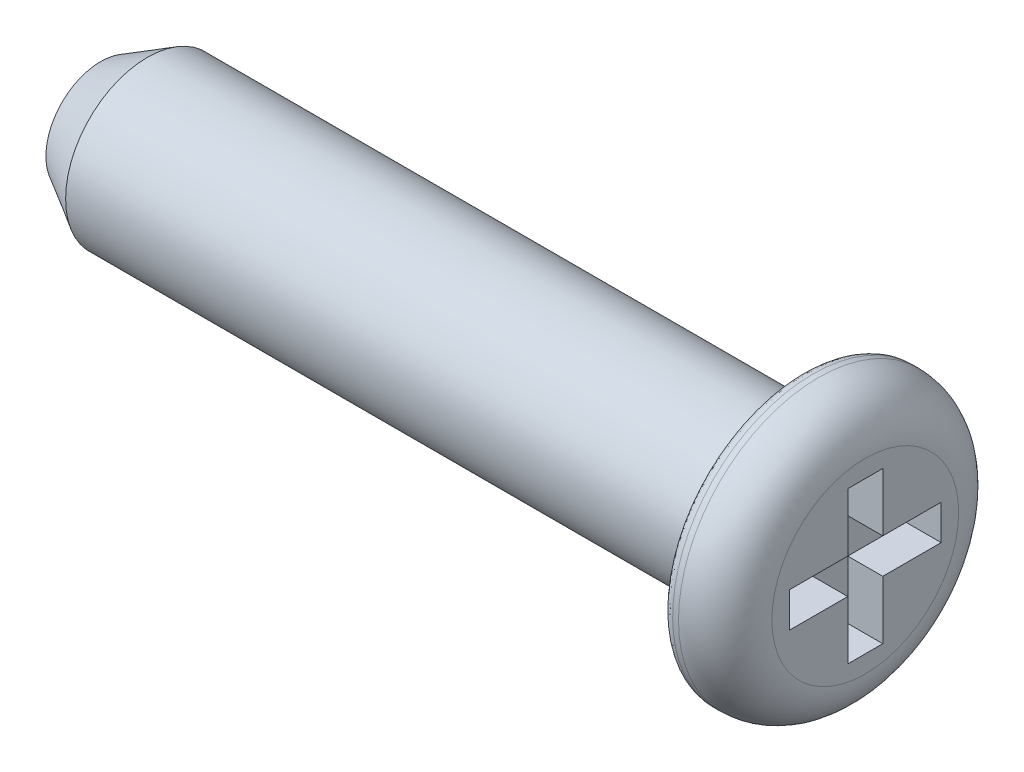
ISO-10303-21;
HEADER;
FILE_DESCRIPTION(('STEP AP214'),'2;1');
FILE_NAME('part.step','',(''),(''),'','','');
FILE_SCHEMA(('AUTOMOTIVE_DESIGN { 1 0 10303 214 1 1 1 1 }'));
ENDSEC;
DATA;
#1=APPLICATION_CONTEXT('core data for automotive mechanical design processes');
#2=APPLICATION_PROTOCOL_DEFINITION('international standard','automotive_design',2000,#1);
#3=PRODUCT_CONTEXT('',#1,'mechanical');
#4=PRODUCT('Part','Part','',(#3));
#5=PRODUCT_RELATED_PRODUCT_CATEGORY('part','',(#4));
#6=PRODUCT_DEFINITION_FORMATION('','',#4);
#7=PRODUCT_DEFINITION_CONTEXT('part definition',#1,'design');
#8=PRODUCT_DEFINITION('design','',#6,#7);
#9=PRODUCT_DEFINITION_SHAPE('','',#8);
#10=(LENGTH_UNIT() NAMED_UNIT(*) SI_UNIT(.MILLI.,.METRE.));
#11=(NAMED_UNIT(*) PLANE_ANGLE_UNIT() SI_UNIT($,.RADIAN.));
#12=(NAMED_UNIT(*) SI_UNIT($,.STERADIAN.) SOLID_ANGLE_UNIT());
#13=UNCERTAINTY_MEASURE_WITH_UNIT(LENGTH_MEASURE(1.E-05),#10,'distance_accuracy_value','');
#14=(GEOMETRIC_REPRESENTATION_CONTEXT(3) GLOBAL_UNCERTAINTY_ASSIGNED_CONTEXT((#13)) GLOBAL_UNIT_ASSIGNED_CONTEXT((#10,
#11,#12)) REPRESENTATION_CONTEXT('',''));
#15=CARTESIAN_POINT('',(0.,0.,0.));
#16=DIRECTION('',(0.,0.,1.));
#17=DIRECTION('',(1.,0.,0.));
#18=AXIS2_PLACEMENT_3D('',#15,#16,#17);
#19=CARTESIAN_POINT('',(6.75,29.024,-5.524));
#20=DIRECTION('',(1.,0.,0.));
#21=DIRECTION('',(0.,0.,-1.));
#22=AXIS2_PLACEMENT_3D('',#19,#20,#21);
#23=PLANE('',#22);
#24=DIRECTION('',(0.,-1.,0.));
#25=VECTOR('',#24,1.);
#26=CARTESIAN_POINT('',(6.75,29.7,-5.55));
#27=LINE('',#26,#25);
#28=CARTESIAN_POINT('',(6.75,29.85,-5.55));
#29=VERTEX_POINT('',#28);
#30=CARTESIAN_POINT('',(6.75,29.55,-5.55));
#31=VERTEX_POINT('',#30);
#32=EDGE_CURVE('E177',#29,#31,#27,.T.);
#33=ORIENTED_EDGE('',*,*,#32,.T.);
#34=DIRECTION('',(0.,0.,-1.));
#35=VECTOR('',#34,1.);
#36=CARTESIAN_POINT('',(6.75,29.55,-5.8));
#37=LINE('',#36,#35);
#38=CARTESIAN_POINT('',(6.75,29.55,-6.05));
#39=VERTEX_POINT('',#38);
#40=EDGE_CURVE('E370',#31,#39,#37,.T.);
#41=ORIENTED_EDGE('',*,*,#40,.T.);
#42=DIRECTION('',(0.,-1.,0.));
#43=VECTOR('',#42,1.);
#44=CARTESIAN_POINT('',(6.75,29.3,-6.05));
#45=LINE('',#44,#43);
#46=CARTESIAN_POINT('',(6.75,29.05,-6.05));
#47=VERTEX_POINT('',#46);
#48=EDGE_CURVE('E363',#39,#47,#45,.T.);
#49=ORIENTED_EDGE('',*,*,#48,.T.);
#50=DIRECTION('',(0.,0.,-1.));
#51=VECTOR('',#50,1.);
#52=CARTESIAN_POINT('',(6.75,29.05,-6.2));
#53=LINE('',#52,#51);
#54=CARTESIAN_POINT('',(6.75,29.05,-6.35));
#55=VERTEX_POINT('',#54);
#56=EDGE_CURVE('E356',#47,#55,#53,.T.);
#57=ORIENTED_EDGE('',*,*,#56,.T.);
#58=DIRECTION('',(0.,1.,0.));
#59=VECTOR('',#58,1.);
#60=CARTESIAN_POINT('',(6.75,29.3,-6.35));
#61=LINE('',#60,#59);
#62=CARTESIAN_POINT('',(6.75,29.55,-6.35));
#63=VERTEX_POINT('',#62);
#64=EDGE_CURVE('E349',#55,#63,#61,.T.);
#65=ORIENTED_EDGE('',*,*,#64,.T.);
#66=DIRECTION('',(0.,0.,-1.));
#67=VECTOR('',#66,1.);
#68=CARTESIAN_POINT('',(6.75,29.55,-6.6));
#69=LINE('',#68,#67);
#70=CARTESIAN_POINT('',(6.75,29.55,-6.85));
#71=VERTEX_POINT('',#70);
#72=EDGE_CURVE('E342',#63,#71,#69,.T.);
#73=ORIENTED_EDGE('',*,*,#72,.T.);
#74=DIRECTION('',(0.,1.,0.));
#75=VECTOR('',#74,1.);
#76=CARTESIAN_POINT('',(6.75,29.7,-6.85));
#77=LINE('',#76,#75);
#78=CARTESIAN_POINT('',(6.75,29.85,-6.85));
#79=VERTEX_POINT('',#78);
#80=EDGE_CURVE('E335',#71,#79,#77,.T.);
#81=ORIENTED_EDGE('',*,*,#80,.T.);
#82=DIRECTION('',(0.,0.,1.));
#83=VECTOR('',#82,1.);
#84=CARTESIAN_POINT('',(6.75,29.85,-6.6));
#85=LINE('',#84,#83);
#86=CARTESIAN_POINT('',(6.75,29.85,-6.35));
#87=VERTEX_POINT('',#86);
#88=EDGE_CURVE('E328',#79,#87,#85,.T.);
#89=ORIENTED_EDGE('',*,*,#88,.T.);
#90=DIRECTION('',(0.,1.,0.));
#91=VECTOR('',#90,1.);
#92=CARTESIAN_POINT('',(6.75,30.1,-6.35));
#93=LINE('',#92,#91);
#94=CARTESIAN_POINT('',(6.75,30.35,-6.35));
#95=VERTEX_POINT('',#94);
#96=EDGE_CURVE('E321',#87,#95,#93,.T.);
#97=ORIENTED_EDGE('',*,*,#96,.T.);
#98=DIRECTION('',(0.,0.,1.));
#99=VECTOR('',#98,1.);
#100=CARTESIAN_POINT('',(6.75,30.35,-6.2));
#101=LINE('',#100,#99);
#102=CARTESIAN_POINT('',(6.75,30.35,-6.05));
#103=VERTEX_POINT('',#102);
#104=EDGE_CURVE('E153',#95,#103,#101,.T.);
#105=ORIENTED_EDGE('',*,*,#104,.T.);
#106=DIRECTION('',(0.,-1.,0.));
#107=VECTOR('',#106,1.);
#108=CARTESIAN_POINT('',(6.75,30.1,-6.05));
#109=LINE('',#108,#107);
#110=CARTESIAN_POINT('',(6.75,29.85,-6.05));
#111=VERTEX_POINT('',#110);
#112=EDGE_CURVE('E150',#103,#111,#109,.T.);
#113=ORIENTED_EDGE('',*,*,#112,.T.);
#114=DIRECTION('',(0.,0.,1.));
#115=VECTOR('',#114,1.);
#116=CARTESIAN_POINT('',(6.75,29.85,-5.8));
#117=LINE('',#116,#115);
#118=EDGE_CURVE('E146',#111,#29,#117,.T.);
#119=ORIENTED_EDGE('',*,*,#118,.T.);
#120=EDGE_LOOP('',(#33,#41,#49,#57,#65,#73,#81,#89,#97,#105,#113,#119));
#121=FACE_BOUND('',#120,.T.);
#122=ADVANCED_FACE('F16',(#121),#23,.T.);
#123=CARTESIAN_POINT('',(6.741146467985,30.36,-6.05));
#124=DIRECTION('',(0.,0.,1.));
#125=DIRECTION('',(0.,-1.,0.));
#126=AXIS2_PLACEMENT_3D('',#123,#124,#125);
#127=PLANE('',#126);
#128=ORIENTED_EDGE('',*,*,#112,.F.);
#129=DIRECTION('',(1.,0.,0.));
#130=VECTOR('',#129,1.);
#131=CARTESIAN_POINT('',(6.9,30.35,-6.05));
#132=LINE('',#131,#130);
#133=CARTESIAN_POINT('',(7.05,30.35,-6.05));
#134=VERTEX_POINT('',#133);
#135=EDGE_CURVE('E307',#103,#134,#132,.T.);
#136=ORIENTED_EDGE('',*,*,#135,.T.);
#137=DIRECTION('',(0.,1.,0.));
#138=VECTOR('',#137,1.);
#139=CARTESIAN_POINT('',(7.05,29.7,-6.05));
#140=LINE('',#139,#138);
#141=CARTESIAN_POINT('',(7.05,29.85,-6.05));
#142=VERTEX_POINT('',#141);
#143=EDGE_CURVE('E162',#134,#142,#140,.F.);
#144=ORIENTED_EDGE('',*,*,#143,.T.);
#145=DIRECTION('',(-1.,0.,0.));
#146=VECTOR('',#145,1.);
#147=CARTESIAN_POINT('',(6.9,29.85,-6.05));
#148=LINE('',#147,#146);
#149=EDGE_CURVE('E157',#142,#111,#148,.T.);
#150=ORIENTED_EDGE('',*,*,#149,.T.);
#151=EDGE_LOOP('',(#128,#136,#144,#150));
#152=FACE_BOUND('',#151,.T.);
#153=ADVANCED_FACE('F160',(#152),#127,.F.);
#154=CARTESIAN_POINT('',(6.741146467985,29.85,-6.06));
#155=DIRECTION('',(0.,1.,0.));
#156=DIRECTION('',(0.,0.,1.));
#157=AXIS2_PLACEMENT_3D('',#154,#155,#156);
#158=PLANE('',#157);
#159=ORIENTED_EDGE('',*,*,#118,.F.);
#160=ORIENTED_EDGE('',*,*,#149,.F.);
#161=DIRECTION('',(0.,0.,-1.));
#162=VECTOR('',#161,1.);
#163=CARTESIAN_POINT('',(7.05,29.85,-6.2));
#164=LINE('',#163,#162);
#165=CARTESIAN_POINT('',(7.05,29.85,-5.55));
#166=VERTEX_POINT('',#165);
#167=EDGE_CURVE('E430',#142,#166,#164,.F.);
#168=ORIENTED_EDGE('',*,*,#167,.T.);
#169=DIRECTION('',(-1.,0.,0.));
#170=VECTOR('',#169,1.);
#171=CARTESIAN_POINT('',(6.9,29.85,-5.55));
#172=LINE('',#171,#170);
#173=EDGE_CURVE('E169',#166,#29,#172,.T.);
#174=ORIENTED_EDGE('',*,*,#173,.T.);
#175=EDGE_LOOP('',(#159,#160,#168,#174));
#176=FACE_BOUND('',#175,.T.);
#177=ADVANCED_FACE('F167',(#176),#158,.F.);
#178=CARTESIAN_POINT('',(6.741146467985,29.85885353202,-5.55));
#179=DIRECTION('',(0.,0.,1.));
#180=DIRECTION('',(0.,-1.,0.));
#181=AXIS2_PLACEMENT_3D('',#178,#179,#180);
#182=PLANE('',#181);
#183=ORIENTED_EDGE('',*,*,#32,.F.);
#184=ORIENTED_EDGE('',*,*,#173,.F.);
#185=DIRECTION('',(0.,1.,0.));
#186=VECTOR('',#185,1.);
#187=CARTESIAN_POINT('',(7.05,29.7,-5.55));
#188=LINE('',#187,#186);
#189=CARTESIAN_POINT('',(7.05,29.55,-5.55));
#190=VERTEX_POINT('',#189);
#191=EDGE_CURVE('E380',#166,#190,#188,.F.);
#192=ORIENTED_EDGE('',*,*,#191,.T.);
#193=DIRECTION('',(-1.,0.,0.));
#194=VECTOR('',#193,1.);
#195=CARTESIAN_POINT('',(6.9,29.55,-5.55));
#196=LINE('',#195,#194);
#197=EDGE_CURVE('E372',#190,#31,#196,.T.);
#198=ORIENTED_EDGE('',*,*,#197,.T.);
#199=EDGE_LOOP('',(#183,#184,#192,#198));
#200=FACE_BOUND('',#199,.T.);
#201=ADVANCED_FACE('F378',(#200),#182,.F.);
#202=CARTESIAN_POINT('',(6.741146467985,29.55,-5.54));
#203=DIRECTION('',(0.,-1.,0.));
#204=DIRECTION('',(0.,0.,-1.));
#205=AXIS2_PLACEMENT_3D('',#202,#203,#204);
#206=PLANE('',#205);
#207=ORIENTED_EDGE('',*,*,#40,.F.);
#208=ORIENTED_EDGE('',*,*,#197,.F.);
#209=DIRECTION('',(0.,0.,1.));
#210=VECTOR('',#209,1.);
#211=CARTESIAN_POINT('',(7.05,29.55,-6.2));
#212=LINE('',#211,#210);
#213=CARTESIAN_POINT('',(7.05,29.55,-6.05));
#214=VERTEX_POINT('',#213);
#215=EDGE_CURVE('E386',#190,#214,#212,.F.);
#216=ORIENTED_EDGE('',*,*,#215,.T.);
#217=DIRECTION('',(-1.,0.,0.));
#218=VECTOR('',#217,1.);
#219=CARTESIAN_POINT('',(6.9,29.55,-6.05));
#220=LINE('',#219,#218);
#221=EDGE_CURVE('E366',#214,#39,#220,.T.);
#222=ORIENTED_EDGE('',*,*,#221,.T.);
#223=EDGE_LOOP('',(#207,#208,#216,#222));
#224=FACE_BOUND('',#223,.T.);
#225=ADVANCED_FACE('F383',(#224),#206,.F.);
#226=CARTESIAN_POINT('',(6.741146467985,29.56,-6.05));
#227=DIRECTION('',(0.,0.,1.));
#228=DIRECTION('',(0.,-1.,0.));
#229=AXIS2_PLACEMENT_3D('',#226,#227,#228);
#230=PLANE('',#229);
#231=ORIENTED_EDGE('',*,*,#48,.F.);
#232=ORIENTED_EDGE('',*,*,#221,.F.);
#233=DIRECTION('',(0.,1.,0.));
#234=VECTOR('',#233,1.);
#235=CARTESIAN_POINT('',(7.05,29.7,-6.05));
#236=LINE('',#235,#234);
#237=CARTESIAN_POINT('',(7.05,29.05,-6.05));
#238=VERTEX_POINT('',#237);
#239=EDGE_CURVE('E439',#214,#238,#236,.F.);
#240=ORIENTED_EDGE('',*,*,#239,.T.);
#241=DIRECTION('',(-1.,0.,0.));
#242=VECTOR('',#241,1.);
#243=CARTESIAN_POINT('',(6.9,29.05,-6.05));
#244=LINE('',#243,#242);
#245=EDGE_CURVE('E359',#238,#47,#244,.T.);
#246=ORIENTED_EDGE('',*,*,#245,.T.);
#247=EDGE_LOOP('',(#231,#232,#240,#246));
#248=FACE_BOUND('',#247,.T.);
#249=ADVANCED_FACE('F389',(#248),#230,.F.);
#250=CARTESIAN_POINT('',(6.741146467985,29.05,-6.041146467985));
#251=DIRECTION('',(0.,-1.,0.));
#252=DIRECTION('',(0.,0.,-1.));
#253=AXIS2_PLACEMENT_3D('',#250,#251,#252);
#254=PLANE('',#253);
#255=ORIENTED_EDGE('',*,*,#56,.F.);
#256=ORIENTED_EDGE('',*,*,#245,.F.);
#257=DIRECTION('',(0.,0.,1.));
#258=VECTOR('',#257,1.);
#259=CARTESIAN_POINT('',(7.05,29.05,-6.2));
#260=LINE('',#259,#258);
#261=CARTESIAN_POINT('',(7.05,29.05,-6.35));
#262=VERTEX_POINT('',#261);
#263=EDGE_CURVE('E397',#238,#262,#260,.F.);
#264=ORIENTED_EDGE('',*,*,#263,.T.);
#265=DIRECTION('',(-1.,0.,0.));
#266=VECTOR('',#265,1.);
#267=CARTESIAN_POINT('',(6.9,29.05,-6.35));
#268=LINE('',#267,#266);
#269=EDGE_CURVE('E352',#262,#55,#268,.T.);
#270=ORIENTED_EDGE('',*,*,#269,.T.);
#271=EDGE_LOOP('',(#255,#256,#264,#270));
#272=FACE_BOUND('',#271,.T.);
#273=ADVANCED_FACE('F395',(#272),#254,.F.);
#274=CARTESIAN_POINT('',(6.741146467985,29.04,-6.35));
#275=DIRECTION('',(0.,0.,-1.));
#276=DIRECTION('',(0.,1.,0.));
#277=AXIS2_PLACEMENT_3D('',#274,#275,#276);
#278=PLANE('',#277);
#279=ORIENTED_EDGE('',*,*,#64,.F.);
#280=ORIENTED_EDGE('',*,*,#269,.F.);
#281=DIRECTION('',(0.,-1.,0.));
#282=VECTOR('',#281,1.);
#283=CARTESIAN_POINT('',(7.05,29.7,-6.35));
#284=LINE('',#283,#282);
#285=CARTESIAN_POINT('',(7.05,29.55,-6.35));
#286=VERTEX_POINT('',#285);
#287=EDGE_CURVE('E403',#262,#286,#284,.F.);
#288=ORIENTED_EDGE('',*,*,#287,.T.);
#289=DIRECTION('',(-1.,0.,0.));
#290=VECTOR('',#289,1.);
#291=CARTESIAN_POINT('',(6.9,29.55,-6.35));
#292=LINE('',#291,#290);
#293=EDGE_CURVE('E345',#286,#63,#292,.T.);
#294=ORIENTED_EDGE('',*,*,#293,.T.);
#295=EDGE_LOOP('',(#279,#280,#288,#294));
#296=FACE_BOUND('',#295,.T.);
#297=ADVANCED_FACE('F400',(#296),#278,.F.);
#298=CARTESIAN_POINT('',(6.741146467985,29.55,-6.34));
#299=DIRECTION('',(0.,-1.,0.));
#300=DIRECTION('',(0.,0.,-1.));
#301=AXIS2_PLACEMENT_3D('',#298,#299,#300);
#302=PLANE('',#301);
#303=ORIENTED_EDGE('',*,*,#72,.F.);
#304=ORIENTED_EDGE('',*,*,#293,.F.);
#305=DIRECTION('',(0.,0.,1.));
#306=VECTOR('',#305,1.);
#307=CARTESIAN_POINT('',(7.05,29.55,-6.2));
#308=LINE('',#307,#306);
#309=CARTESIAN_POINT('',(7.05,29.55,-6.85));
#310=VERTEX_POINT('',#309);
#311=EDGE_CURVE('E446',#286,#310,#308,.F.);
#312=ORIENTED_EDGE('',*,*,#311,.T.);
#313=DIRECTION('',(-1.,0.,0.));
#314=VECTOR('',#313,1.);
#315=CARTESIAN_POINT('',(6.9,29.55,-6.85));
#316=LINE('',#315,#314);
#317=EDGE_CURVE('E338',#310,#71,#316,.T.);
#318=ORIENTED_EDGE('',*,*,#317,.T.);
#319=EDGE_LOOP('',(#303,#304,#312,#318));
#320=FACE_BOUND('',#319,.T.);
#321=ADVANCED_FACE('F406',(#320),#302,.F.);
#322=CARTESIAN_POINT('',(6.741146467985,29.54114646798,-6.85));
#323=DIRECTION('',(0.,0.,-1.));
#324=DIRECTION('',(0.,1.,0.));
#325=AXIS2_PLACEMENT_3D('',#322,#323,#324);
#326=PLANE('',#325);
#327=ORIENTED_EDGE('',*,*,#80,.F.);
#328=ORIENTED_EDGE('',*,*,#317,.F.);
#329=DIRECTION('',(0.,-1.,0.));
#330=VECTOR('',#329,1.);
#331=CARTESIAN_POINT('',(7.05,29.7,-6.85));
#332=LINE('',#331,#330);
#333=CARTESIAN_POINT('',(7.05,29.85,-6.85));
#334=VERTEX_POINT('',#333);
#335=EDGE_CURVE('E414',#310,#334,#332,.F.);
#336=ORIENTED_EDGE('',*,*,#335,.T.);
#337=DIRECTION('',(-1.,0.,0.));
#338=VECTOR('',#337,1.);
#339=CARTESIAN_POINT('',(6.9,29.85,-6.85));
#340=LINE('',#339,#338);
#341=EDGE_CURVE('E331',#334,#79,#340,.T.);
#342=ORIENTED_EDGE('',*,*,#341,.T.);
#343=EDGE_LOOP('',(#327,#328,#336,#342));
#344=FACE_BOUND('',#343,.T.);
#345=ADVANCED_FACE('F412',(#344),#326,.F.);
#346=CARTESIAN_POINT('',(6.741146467985,29.85,-6.86));
#347=DIRECTION('',(0.,1.,0.));
#348=DIRECTION('',(0.,0.,1.));
#349=AXIS2_PLACEMENT_3D('',#346,#347,#348);
#350=PLANE('',#349);
#351=ORIENTED_EDGE('',*,*,#88,.F.);
#352=ORIENTED_EDGE('',*,*,#341,.F.);
#353=DIRECTION('',(0.,0.,-1.));
#354=VECTOR('',#353,1.);
#355=CARTESIAN_POINT('',(7.05,29.85,-6.2));
#356=LINE('',#355,#354);
#357=CARTESIAN_POINT('',(7.05,29.85,-6.35));
#358=VERTEX_POINT('',#357);
#359=EDGE_CURVE('E420',#334,#358,#356,.F.);
#360=ORIENTED_EDGE('',*,*,#359,.T.);
#361=DIRECTION('',(-1.,0.,0.));
#362=VECTOR('',#361,1.);
#363=CARTESIAN_POINT('',(6.9,29.85,-6.35));
#364=LINE('',#363,#362);
#365=EDGE_CURVE('E324',#358,#87,#364,.T.);
#366=ORIENTED_EDGE('',*,*,#365,.T.);
#367=EDGE_LOOP('',(#351,#352,#360,#366));
#368=FACE_BOUND('',#367,.T.);
#369=ADVANCED_FACE('F417',(#368),#350,.F.);
#370=CARTESIAN_POINT('',(6.741146467985,29.84,-6.35));
#371=DIRECTION('',(0.,0.,-1.));
#372=DIRECTION('',(0.,1.,0.));
#373=AXIS2_PLACEMENT_3D('',#370,#371,#372);
#374=PLANE('',#373);
#375=ORIENTED_EDGE('',*,*,#96,.F.);
#376=ORIENTED_EDGE('',*,*,#365,.F.);
#377=DIRECTION('',(0.,-1.,0.));
#378=VECTOR('',#377,1.);
#379=CARTESIAN_POINT('',(7.05,29.7,-6.35));
#380=LINE('',#379,#378);
#381=CARTESIAN_POINT('',(7.05,30.35,-6.35));
#382=VERTEX_POINT('',#381);
#383=EDGE_CURVE('E425',#358,#382,#380,.F.);
#384=ORIENTED_EDGE('',*,*,#383,.T.);
#385=DIRECTION('',(-1.,0.,0.));
#386=VECTOR('',#385,1.);
#387=CARTESIAN_POINT('',(6.9,30.35,-6.35));
#388=LINE('',#387,#386);
#389=EDGE_CURVE('E317',#382,#95,#388,.T.);
#390=ORIENTED_EDGE('',*,*,#389,.T.);
#391=EDGE_LOOP('',(#375,#376,#384,#390));
#392=FACE_BOUND('',#391,.T.);
#393=ADVANCED_FACE('F423',(#392),#374,.F.);
#394=CARTESIAN_POINT('',(6.741146467985,30.35,-6.358853532015));
#395=DIRECTION('',(0.,1.,0.));
#396=DIRECTION('',(0.,0.,1.));
#397=AXIS2_PLACEMENT_3D('',#394,#395,#396);
#398=PLANE('',#397);
#399=ORIENTED_EDGE('',*,*,#104,.F.);
#400=ORIENTED_EDGE('',*,*,#389,.F.);
#401=DIRECTION('',(0.,0.,-1.));
#402=VECTOR('',#401,1.);
#403=CARTESIAN_POINT('',(7.05,30.35,-6.2));
#404=LINE('',#403,#402);
#405=EDGE_CURVE('E290',#382,#134,#404,.F.);
#406=ORIENTED_EDGE('',*,*,#405,.T.);
#407=ORIENTED_EDGE('',*,*,#135,.F.);
#408=EDGE_LOOP('',(#399,#400,#406,#407));
#409=FACE_BOUND('',#408,.T.);
#410=ADVANCED_FACE('F201',(#409),#398,.F.);
#411=CARTESIAN_POINT('',(7.05,28.86716642063,-5.368));
#412=DIRECTION('',(1.,0.,0.));
#413=DIRECTION('',(0.,0.,-1.));
#414=AXIS2_PLACEMENT_3D('',#411,#412,#413);
#415=PLANE('',#414);
#416=ORIENTED_EDGE('',*,*,#383,.F.);
#417=ORIENTED_EDGE('',*,*,#359,.F.);
#418=ORIENTED_EDGE('',*,*,#335,.F.);
#419=ORIENTED_EDGE('',*,*,#311,.F.);
#420=ORIENTED_EDGE('',*,*,#287,.F.);
#421=ORIENTED_EDGE('',*,*,#263,.F.);
#422=ORIENTED_EDGE('',*,*,#239,.F.);
#423=ORIENTED_EDGE('',*,*,#215,.F.);
#424=ORIENTED_EDGE('',*,*,#191,.F.);
#425=ORIENTED_EDGE('',*,*,#167,.F.);
#426=ORIENTED_EDGE('',*,*,#143,.F.);
#427=ORIENTED_EDGE('',*,*,#405,.F.);
#428=EDGE_LOOP('',(#416,#417,#418,#419,#420,#421,#422,#423,#424,#425,#426,#427));
#429=FACE_BOUND('',#428,.T.);
#430=CARTESIAN_POINT('',(7.05000000000001,29.7,-6.2));
#431=DIRECTION('',(-1.,0.,0.));
#432=DIRECTION('',(0.,-8.02309616660543E-13,-1.));
#433=AXIS2_PLACEMENT_3D('',#430,#431,#432);
#434=CIRCLE('',#433,0.7999999910047);
#435=CARTESIAN_POINT('',(7.05000000000001,29.7000000000001,-5.4000000080958));
#436=VERTEX_POINT('',#435);
#437=CARTESIAN_POINT('',(7.05000000000001,29.6999999999996,-6.9999999919042));
#438=VERTEX_POINT('',#437);
#439=EDGE_CURVE('E184',#436,#438,#434,.F.);
#440=ORIENTED_EDGE('',*,*,#439,.T.);
#441=CARTESIAN_POINT('',(7.05000000000001,29.7,-6.2));
#442=DIRECTION('',(-1.,0.,0.));
#443=DIRECTION('',(0.,0.,1.));
#444=AXIS2_PLACEMENT_3D('',#441,#442,#443);
#445=CIRCLE('',#444,0.799999991004702);
#446=EDGE_CURVE('E285',#438,#436,#445,.F.);
#447=ORIENTED_EDGE('',*,*,#446,.T.);
#448=EDGE_LOOP('',(#440,#447));
#449=FACE_BOUND('',#448,.T.);
#450=ADVANCED_FACE('F191',(#429,#449),#415,.T.);
#451=CARTESIAN_POINT('',(6.63743568920142,29.688657572761,-7.39974900946468));
#452=CARTESIAN_POINT('',(6.88347384142366,29.6885844770859,-7.40748072879281));
#453=CARTESIAN_POINT('',(7.05753489804068,29.6902299782706,-7.2334272942651));
#454=CARTESIAN_POINT('',(7.04980261265878,29.6925559189753,-6.98740014344981));
#455=(BOUNDED_CURVE() B_SPLINE_CURVE(3,(#451,#452,#453,#454),.UNSPECIFIED.,.F.,
.F.) B_SPLINE_CURVE_WITH_KNOTS((4,4),(0.,1.),
.UNSPECIFIED.) CURVE() GEOMETRIC_REPRESENTATION_ITEM() RATIONAL_B_SPLINE_CURVE((1.,
0.789697844101267,0.789697844101267,1.)) REPRESENTATION_ITEM(''));
#456=CARTESIAN_POINT('',(6.65,29.7,-6.2));
#457=DIRECTION('',(1.,0.,0.));
#458=AXIS1_PLACEMENT('',#456,#457);
#459=SURFACE_OF_REVOLUTION('',#455,#458);
#460=CARTESIAN_POINT('',(6.65,29.7,-6.2));
#461=DIRECTION('',(1.,0.,0.));
#462=DIRECTION('',(0.,0.,-1.));
#463=AXIS2_PLACEMENT_3D('',#460,#461,#462);
#464=CIRCLE('',#463,1.2);
#465=CARTESIAN_POINT('',(6.65,29.7,-7.4));
#466=VERTEX_POINT('',#465);
#467=EDGE_CURVE('E281',#466,#466,#464,.T.);
#468=ORIENTED_EDGE('',*,*,#467,.T.);
#469=EDGE_LOOP('',(#468));
#470=FACE_BOUND('',#469,.T.);
#471=ORIENTED_EDGE('',*,*,#439,.F.);
#472=ORIENTED_EDGE('',*,*,#446,.F.);
#473=EDGE_LOOP('',(#471,#472));
#474=FACE_BOUND('',#473,.T.);
#475=ADVANCED_FACE('F200',(#470,#474),#459,.T.);
#476=CARTESIAN_POINT('',(6.6,29.7,-6.2));
#477=DIRECTION('',(1.,0.,0.));
#478=DIRECTION('',(0.,1.,0.));
#479=AXIS2_PLACEMENT_3D('',#476,#477,#478);
#480=CYLINDRICAL_SURFACE('',#479,1.2);
#481=CARTESIAN_POINT('',(6.6,29.7,-6.2));
#482=DIRECTION('',(1.,0.,0.));
#483=DIRECTION('',(0.,-0.0134291293998733,0.999909825176031));
#484=AXIS2_PLACEMENT_3D('',#481,#482,#483);
#485=CIRCLE('',#484,1.20000000000037);
#486=CARTESIAN_POINT('',(6.6,29.6838850447201,-5.0001082097884));
#487=VERTEX_POINT('',#486);
#488=EDGE_CURVE('E277',#487,#487,#485,.T.);
#489=ORIENTED_EDGE('',*,*,#488,.T.);
#490=EDGE_LOOP('',(#489));
#491=FACE_BOUND('',#490,.T.);
#492=ORIENTED_EDGE('',*,*,#467,.F.);
#493=EDGE_LOOP('',(#492));
#494=FACE_BOUND('',#493,.T.);
#495=ADVANCED_FACE('F253',(#491,#494),#480,.T.);
#496=CARTESIAN_POINT('',(6.50039170687413,29.68534670332,-5.10894078944785));
#497=CARTESIAN_POINT('',(6.49445300850722,29.6844483136756,-5.04204824522114));
#498=CARTESIAN_POINT('',(6.54194336804711,29.6838105567751,-4.99456196581039));
#499=CARTESIAN_POINT('',(6.60884197014127,29.6838903044966,-5.00049984367342));
#500=(BOUNDED_CURVE() B_SPLINE_CURVE(3,(#496,#497,#498,#499),.UNSPECIFIED.,.F.,
.F.) B_SPLINE_CURVE_WITH_KNOTS((4,4),(0.,1.),
.UNSPECIFIED.) CURVE() GEOMETRIC_REPRESENTATION_ITEM() RATIONAL_B_SPLINE_CURVE((1.,
0.761208971798789,0.761208971798789,1.)) REPRESENTATION_ITEM(''));
#501=CARTESIAN_POINT('',(6.6,29.7,-6.2));
#502=DIRECTION('',(1.,0.,0.));
#503=AXIS1_PLACEMENT('',#501,#502);
#504=SURFACE_OF_REVOLUTION('',#500,#503);
#505=ORIENTED_EDGE('',*,*,#488,.F.);
#506=EDGE_LOOP('',(#505));
#507=FACE_BOUND('',#506,.T.);
#508=CARTESIAN_POINT('',(6.5,29.7,-6.2));
#509=DIRECTION('',(1.,0.,0.));
#510=DIRECTION('',(0.,0.,1.));
#511=AXIS2_PLACEMENT_3D('',#508,#509,#510);
#512=CIRCLE('',#511,1.09999998207468);
#513=CARTESIAN_POINT('',(6.5,29.6999999999999,-5.10000002509559));
#514=VERTEX_POINT('',#513);
#515=CARTESIAN_POINT('',(6.5,29.7,-7.29999997490441));
#516=VERTEX_POINT('',#515);
#517=EDGE_CURVE('E40',#514,#516,#512,.T.);
#518=ORIENTED_EDGE('',*,*,#517,.T.);
#519=CARTESIAN_POINT('',(6.5,29.7,-6.2));
#520=DIRECTION('',(1.,0.,0.));
#521=DIRECTION('',(0.,0.,-1.));
#522=AXIS2_PLACEMENT_3D('',#519,#520,#521);
#523=CIRCLE('',#522,1.09999998207468);
#524=EDGE_CURVE('E226',#516,#514,#523,.T.);
#525=ORIENTED_EDGE('',*,*,#524,.T.);
#526=EDGE_LOOP('',(#518,#525));
#527=FACE_BOUND('',#526,.T.);
#528=ADVANCED_FACE('F242',(#507,#527),#504,.T.);
#529=CARTESIAN_POINT('',(6.5,28.55599999748,-5.056));
#530=DIRECTION('',(1.,0.,0.));
#531=DIRECTION('',(0.,0.,-1.));
#532=AXIS2_PLACEMENT_3D('',#529,#530,#531);
#533=PLANE('',#532);
#534=CARTESIAN_POINT('',(6.5,29.7,-6.2));
#535=DIRECTION('',(-1.,0.,0.));
#536=DIRECTION('',(0.,0.,1.));
#537=AXIS2_PLACEMENT_3D('',#534,#535,#536);
#538=CIRCLE('',#537,0.699999999999996);
#539=CARTESIAN_POINT('',(6.5,29.7,-5.50000000000001));
#540=VERTEX_POINT('',#539);
#541=EDGE_CURVE('E235',#540,#540,#538,.F.);
#542=ORIENTED_EDGE('',*,*,#541,.T.);
#543=EDGE_LOOP('',(#542));
#544=FACE_BOUND('',#543,.T.);
#545=ORIENTED_EDGE('',*,*,#517,.F.);
#546=ORIENTED_EDGE('',*,*,#524,.F.);
#547=EDGE_LOOP('',(#545,#546));
#548=FACE_BOUND('',#547,.T.);
#549=ADVANCED_FACE('F204',(#544,#548),#533,.F.);
#550=CARTESIAN_POINT('',(6.5,29.7,-6.2));
#551=DIRECTION('',(-1.,0.,0.));
#552=DIRECTION('',(0.,0.,1.));
#553=AXIS2_PLACEMENT_3D('',#550,#551,#552);
#554=CYLINDRICAL_SURFACE('',#553,0.699999999999996);
#555=CARTESIAN_POINT('',(0.900000000001497,29.7,-6.2));
#556=DIRECTION('',(-1.,0.,0.));
#557=DIRECTION('',(0.,-1.,0.));
#558=AXIS2_PLACEMENT_3D('',#555,#556,#557);
#559=CIRCLE('',#558,0.699999999997408);
#560=CARTESIAN_POINT('',(0.900000000001497,29.0000000000026,-6.2));
#561=VERTEX_POINT('',#560);
#562=EDGE_CURVE('E29',#561,#561,#559,.F.);
#563=ORIENTED_EDGE('',*,*,#562,.T.);
#564=EDGE_LOOP('',(#563));
#565=FACE_BOUND('',#564,.T.);
#566=ORIENTED_EDGE('',*,*,#541,.F.);
#567=EDGE_LOOP('',(#566));
#568=FACE_BOUND('',#567,.T.);
#569=ADVANCED_FACE('F255',(#565,#568),#554,.T.);
#570=CARTESIAN_POINT('',(0.900000000001497,29.7,-6.2));
#571=DIRECTION('',(1.,0.,0.));
#572=DIRECTION('',(0.,0.,-1.));
#573=AXIS2_PLACEMENT_3D('',#570,#571,#572);
#574=CONICAL_SURFACE('',#573,0.699999999997408,0.523598775593107);
#575=ORIENTED_EDGE('',*,*,#562,.F.);
#576=EDGE_LOOP('',(#575));
#577=FACE_BOUND('',#576,.T.);
#578=CARTESIAN_POINT('',(0.500000000000277,29.7,-6.2));
#579=DIRECTION('',(1.,0.,0.));
#580=DIRECTION('',(0.,0.,-1.));
#581=AXIS2_PLACEMENT_3D('',#578,#579,#580);
#582=CIRCLE('',#581,0.469059892323622);
#583=CARTESIAN_POINT('',(0.500000000000277,29.7,-6.66905989232362));
#584=VERTEX_POINT('',#583);
#585=EDGE_CURVE('E11',#584,#584,#582,.T.);
#586=ORIENTED_EDGE('',*,*,#585,.T.);
#587=EDGE_LOOP('',(#586));
#588=FACE_BOUND('',#587,.T.);
#589=ADVANCED_FACE('F466',(#577,#588),#574,.T.);
#590=CARTESIAN_POINT('',(0.5,30.18782228802,-6.687822288017));
#591=DIRECTION('',(-1.,0.,0.));
#592=DIRECTION('',(0.,-1.,0.));
#593=AXIS2_PLACEMENT_3D('',#590,#591,#592);
#594=PLANE('',#593);
#595=ORIENTED_EDGE('',*,*,#585,.F.);
#596=EDGE_LOOP('',(#595));
#597=FACE_BOUND('',#596,.T.);
#598=ADVANCED_FACE('F18',(#597),#594,.T.);
#599=CLOSED_SHELL('',(#122,#153,#177,#201,#225,#249,#273,#297,#321,#345,#369,#393,#410,#450,
#475,#495,#528,#549,#569,#589,#598));
#600=MANIFOLD_SOLID_BREP('B1',#599);
#601=ADVANCED_BREP_SHAPE_REPRESENTATION('',(#18,#600),#14);
#602=SHAPE_DEFINITION_REPRESENTATION(#9,#601);
ENDSEC;
END-ISO-10303-21;
